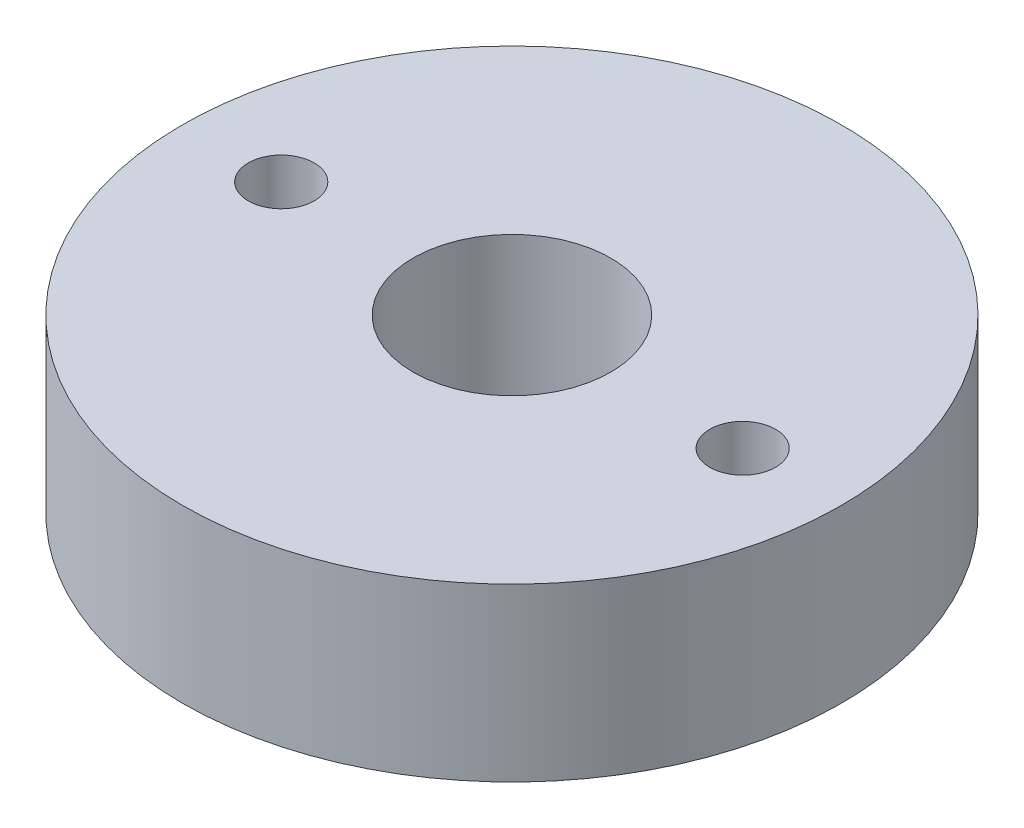
ISO-10303-21;
HEADER;
FILE_DESCRIPTION(('STEP AP214'),'2;1');
FILE_NAME('part.step','',(''),(''),'','','');
FILE_SCHEMA(('AUTOMOTIVE_DESIGN { 1 0 10303 214 1 1 1 1 }'));
ENDSEC;
DATA;
#1=APPLICATION_CONTEXT('core data for automotive mechanical design processes');
#2=APPLICATION_PROTOCOL_DEFINITION('international standard','automotive_design',2000,#1);
#3=PRODUCT_CONTEXT('',#1,'mechanical');
#4=PRODUCT('Part','Part','',(#3));
#5=PRODUCT_RELATED_PRODUCT_CATEGORY('part','',(#4));
#6=PRODUCT_DEFINITION_FORMATION('','',#4);
#7=PRODUCT_DEFINITION_CONTEXT('part definition',#1,'design');
#8=PRODUCT_DEFINITION('design','',#6,#7);
#9=PRODUCT_DEFINITION_SHAPE('','',#8);
#10=(LENGTH_UNIT() NAMED_UNIT(*) SI_UNIT(.MILLI.,.METRE.));
#11=(NAMED_UNIT(*) PLANE_ANGLE_UNIT() SI_UNIT($,.RADIAN.));
#12=(NAMED_UNIT(*) SI_UNIT($,.STERADIAN.) SOLID_ANGLE_UNIT());
#13=UNCERTAINTY_MEASURE_WITH_UNIT(LENGTH_MEASURE(1.E-05),#10,'distance_accuracy_value','');
#14=(GEOMETRIC_REPRESENTATION_CONTEXT(3) GLOBAL_UNCERTAINTY_ASSIGNED_CONTEXT((#13)) GLOBAL_UNIT_ASSIGNED_CONTEXT((#10,
#11,#12)) REPRESENTATION_CONTEXT('',''));
#15=CARTESIAN_POINT('',(0.,0.,0.));
#16=DIRECTION('',(0.,0.,1.));
#17=DIRECTION('',(1.,0.,0.));
#18=AXIS2_PLACEMENT_3D('',#15,#16,#17);
#19=CARTESIAN_POINT('',(0.,2.6,0.));
#20=DIRECTION('',(0.,-1.,0.));
#21=DIRECTION('',(0.,0.,-1.));
#22=AXIS2_PLACEMENT_3D('',#19,#20,#21);
#23=CYLINDRICAL_SURFACE('',#22,5.);
#24=CARTESIAN_POINT('',(0.,2.6,0.));
#25=DIRECTION('',(0.,1.,0.));
#26=DIRECTION('',(0.,0.,1.));
#27=AXIS2_PLACEMENT_3D('',#24,#25,#26);
#28=CIRCLE('',#27,5.);
#29=CARTESIAN_POINT('',(0.,2.6,5.));
#30=VERTEX_POINT('',#29);
#31=EDGE_CURVE('E10',#30,#30,#28,.T.);
#32=ORIENTED_EDGE('',*,*,#31,.F.);
#33=EDGE_LOOP('',(#32));
#34=FACE_BOUND('',#33,.T.);
#35=CARTESIAN_POINT('',(0.,0.,0.));
#36=DIRECTION('',(0.,1.,0.));
#37=DIRECTION('',(0.,0.,1.));
#38=AXIS2_PLACEMENT_3D('',#35,#36,#37);
#39=CIRCLE('',#38,5.);
#40=CARTESIAN_POINT('',(0.,0.,5.));
#41=VERTEX_POINT('',#40);
#42=EDGE_CURVE('E17',#41,#41,#39,.T.);
#43=ORIENTED_EDGE('',*,*,#42,.T.);
#44=EDGE_LOOP('',(#43));
#45=FACE_BOUND('',#44,.T.);
#46=ADVANCED_FACE('F14',(#34,#45),#23,.T.);
#47=CARTESIAN_POINT('',(0.,2.6,0.));
#48=DIRECTION('',(0.,1.,0.));
#49=DIRECTION('',(0.,0.,1.));
#50=AXIS2_PLACEMENT_3D('',#47,#48,#49);
#51=PLANE('',#50);
#52=CARTESIAN_POINT('',(-3.5,2.6,0.));
#53=DIRECTION('',(0.,1.,0.));
#54=DIRECTION('',(0.,0.,1.));
#55=AXIS2_PLACEMENT_3D('',#52,#53,#54);
#56=CIRCLE('',#55,0.5);
#57=CARTESIAN_POINT('',(-3.5,2.6,0.5));
#58=VERTEX_POINT('',#57);
#59=EDGE_CURVE('E38',#58,#58,#56,.T.);
#60=ORIENTED_EDGE('',*,*,#59,.F.);
#61=EDGE_LOOP('',(#60));
#62=FACE_BOUND('',#61,.T.);
#63=CARTESIAN_POINT('',(3.5,2.6,0.));
#64=DIRECTION('',(0.,1.,0.));
#65=DIRECTION('',(0.,0.,1.));
#66=AXIS2_PLACEMENT_3D('',#63,#64,#65);
#67=CIRCLE('',#66,0.5);
#68=CARTESIAN_POINT('',(3.5,2.6,0.5));
#69=VERTEX_POINT('',#68);
#70=EDGE_CURVE('E32',#69,#69,#67,.T.);
#71=ORIENTED_EDGE('',*,*,#70,.F.);
#72=EDGE_LOOP('',(#71));
#73=FACE_BOUND('',#72,.T.);
#74=CARTESIAN_POINT('',(0.,2.6,0.));
#75=DIRECTION('',(0.,1.,0.));
#76=DIRECTION('',(0.,0.,1.));
#77=AXIS2_PLACEMENT_3D('',#74,#75,#76);
#78=CIRCLE('',#77,1.49999999999999);
#79=CARTESIAN_POINT('',(0.,2.6,1.49999999999999));
#80=VERTEX_POINT('',#79);
#81=EDGE_CURVE('E28',#80,#80,#78,.T.);
#82=ORIENTED_EDGE('',*,*,#81,.F.);
#83=EDGE_LOOP('',(#82));
#84=FACE_BOUND('',#83,.T.);
#85=ORIENTED_EDGE('',*,*,#31,.T.);
#86=EDGE_LOOP('',(#85));
#87=FACE_BOUND('',#86,.T.);
#88=ADVANCED_FACE('F54',(#62,#73,#84,#87),#51,.T.);
#89=CARTESIAN_POINT('',(0.,0.,0.));
#90=DIRECTION('',(0.,1.,0.));
#91=DIRECTION('',(0.,0.,1.));
#92=AXIS2_PLACEMENT_3D('',#89,#90,#91);
#93=PLANE('',#92);
#94=CARTESIAN_POINT('',(-3.5,0.,0.));
#95=DIRECTION('',(0.,1.,0.));
#96=DIRECTION('',(0.,0.,1.));
#97=AXIS2_PLACEMENT_3D('',#94,#95,#96);
#98=CIRCLE('',#97,0.5);
#99=CARTESIAN_POINT('',(-3.5,0.,0.5));
#100=VERTEX_POINT('',#99);
#101=EDGE_CURVE('E35',#100,#100,#98,.T.);
#102=ORIENTED_EDGE('',*,*,#101,.T.);
#103=EDGE_LOOP('',(#102));
#104=FACE_BOUND('',#103,.T.);
#105=CARTESIAN_POINT('',(3.5,0.,0.));
#106=DIRECTION('',(0.,1.,0.));
#107=DIRECTION('',(0.,0.,1.));
#108=AXIS2_PLACEMENT_3D('',#105,#106,#107);
#109=CIRCLE('',#108,0.5);
#110=CARTESIAN_POINT('',(3.5,0.,0.5));
#111=VERTEX_POINT('',#110);
#112=EDGE_CURVE('E31',#111,#111,#109,.T.);
#113=ORIENTED_EDGE('',*,*,#112,.T.);
#114=EDGE_LOOP('',(#113));
#115=FACE_BOUND('',#114,.T.);
#116=CARTESIAN_POINT('',(0.,0.,0.));
#117=DIRECTION('',(0.,1.,0.));
#118=DIRECTION('',(0.,0.,1.));
#119=AXIS2_PLACEMENT_3D('',#116,#117,#118);
#120=CIRCLE('',#119,1.5);
#121=CARTESIAN_POINT('',(0.,0.,1.5));
#122=VERTEX_POINT('',#121);
#123=EDGE_CURVE('E24',#122,#122,#120,.T.);
#124=ORIENTED_EDGE('',*,*,#123,.T.);
#125=EDGE_LOOP('',(#124));
#126=FACE_BOUND('',#125,.T.);
#127=ORIENTED_EDGE('',*,*,#42,.F.);
#128=EDGE_LOOP('',(#127));
#129=FACE_BOUND('',#128,.T.);
#130=ADVANCED_FACE('F44',(#104,#115,#126,#129),#93,.F.);
#131=CARTESIAN_POINT('',(0.,2.6,0.));
#132=DIRECTION('',(0.,1.,0.));
#133=DIRECTION('',(0.,0.,1.));
#134=AXIS2_PLACEMENT_3D('',#131,#132,#133);
#135=CYLINDRICAL_SURFACE('',#134,1.5);
#136=ORIENTED_EDGE('',*,*,#123,.F.);
#137=EDGE_LOOP('',(#136));
#138=FACE_BOUND('',#137,.T.);
#139=ORIENTED_EDGE('',*,*,#81,.T.);
#140=EDGE_LOOP('',(#139));
#141=FACE_BOUND('',#140,.T.);
#142=ADVANCED_FACE('F62',(#138,#141),#135,.F.);
#143=CARTESIAN_POINT('',(3.5,0.,0.));
#144=DIRECTION('',(0.,1.,0.));
#145=DIRECTION('',(0.,0.,1.));
#146=AXIS2_PLACEMENT_3D('',#143,#144,#145);
#147=CYLINDRICAL_SURFACE('',#146,0.5);
#148=ORIENTED_EDGE('',*,*,#112,.F.);
#149=EDGE_LOOP('',(#148));
#150=FACE_BOUND('',#149,.T.);
#151=ORIENTED_EDGE('',*,*,#70,.T.);
#152=EDGE_LOOP('',(#151));
#153=FACE_BOUND('',#152,.T.);
#154=ADVANCED_FACE('F50',(#150,#153),#147,.F.);
#155=CARTESIAN_POINT('',(-3.5,0.,0.));
#156=DIRECTION('',(0.,1.,0.));
#157=DIRECTION('',(0.,0.,1.));
#158=AXIS2_PLACEMENT_3D('',#155,#156,#157);
#159=CYLINDRICAL_SURFACE('',#158,0.5);
#160=ORIENTED_EDGE('',*,*,#101,.F.);
#161=EDGE_LOOP('',(#160));
#162=FACE_BOUND('',#161,.T.);
#163=ORIENTED_EDGE('',*,*,#59,.T.);
#164=EDGE_LOOP('',(#163));
#165=FACE_BOUND('',#164,.T.);
#166=ADVANCED_FACE('F47',(#162,#165),#159,.F.);
#167=CLOSED_SHELL('',(#46,#88,#130,#142,#154,#166));
#168=MANIFOLD_SOLID_BREP('B1',#167);
#169=ADVANCED_BREP_SHAPE_REPRESENTATION('',(#18,#168),#14);
#170=SHAPE_DEFINITION_REPRESENTATION(#9,#169);
ENDSEC;
END-ISO-10303-21;
